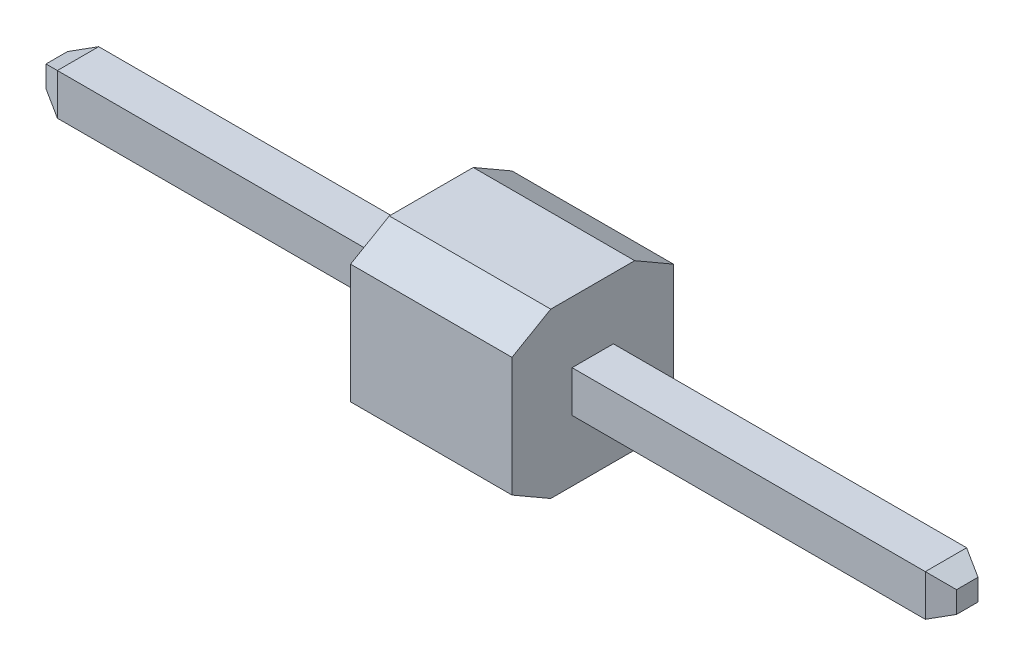
ISO-10303-21;
HEADER;
FILE_DESCRIPTION(('STEP AP214'),'2;1');
FILE_NAME('part.step','',(''),(''),'','','');
FILE_SCHEMA(('AUTOMOTIVE_DESIGN { 1 0 10303 214 1 1 1 1 }'));
ENDSEC;
DATA;
#1=APPLICATION_CONTEXT('core data for automotive mechanical design processes');
#2=APPLICATION_PROTOCOL_DEFINITION('international standard','automotive_design',2000,#1);
#3=PRODUCT_CONTEXT('',#1,'mechanical');
#4=PRODUCT('Part','Part','',(#3));
#5=PRODUCT_RELATED_PRODUCT_CATEGORY('part','',(#4));
#6=PRODUCT_DEFINITION_FORMATION('','',#4);
#7=PRODUCT_DEFINITION_CONTEXT('part definition',#1,'design');
#8=PRODUCT_DEFINITION('design','',#6,#7);
#9=PRODUCT_DEFINITION_SHAPE('','',#8);
#10=(LENGTH_UNIT() NAMED_UNIT(*) SI_UNIT(.MILLI.,.METRE.));
#11=(NAMED_UNIT(*) PLANE_ANGLE_UNIT() SI_UNIT($,.RADIAN.));
#12=(NAMED_UNIT(*) SI_UNIT($,.STERADIAN.) SOLID_ANGLE_UNIT());
#13=UNCERTAINTY_MEASURE_WITH_UNIT(LENGTH_MEASURE(1.E-05),#10,'distance_accuracy_value','');
#14=(GEOMETRIC_REPRESENTATION_CONTEXT(3) GLOBAL_UNCERTAINTY_ASSIGNED_CONTEXT((#13)) GLOBAL_UNIT_ASSIGNED_CONTEXT((#10,
#11,#12)) REPRESENTATION_CONTEXT('',''));
#15=CARTESIAN_POINT('',(0.,0.,0.));
#16=DIRECTION('',(0.,0.,1.));
#17=DIRECTION('',(1.,0.,0.));
#18=AXIS2_PLACEMENT_3D('',#15,#16,#17);
#19=CARTESIAN_POINT('',(5.42107505657293,-2.85712826291391,0.629998634255617));
#20=DIRECTION('',(1.,4.37113882867379E-08,-4.37113882867379E-08));
#21=DIRECTION('',(-4.37113882867379E-08,1.,0.));
#22=AXIS2_PLACEMENT_3D('',#19,#20,#21);
#23=PLANE('',#22);
#24=DIRECTION('',(1.59994777304463E-08,0.500000000000193,0.866025403784327));
#25=VECTOR('',#24,1.);
#26=CARTESIAN_POINT('',(5.42107493358702,-1.61353842442391,-0.940001365744382));
#27=LINE('',#26,#25);
#28=CARTESIAN_POINT('',(5.42107493358702,-1.61353842442391,-0.940001365744382));
#29=VERTEX_POINT('',#28);
#30=CARTESIAN_POINT('',(5.42107494467178,-1.26712826291391,-0.340001365744383));
#31=VERTEX_POINT('',#30);
#32=EDGE_CURVE('E11',#29,#31,#27,.T.);
#33=ORIENTED_EDGE('',*,*,#32,.T.);
#34=DIRECTION('',(4.37113886966664E-08,0.,0.999999999999999));
#35=VECTOR('',#34,1.);
#36=CARTESIAN_POINT('',(5.42107494467178,-1.26712826291391,-0.340001365744383));
#37=LINE('',#36,#35);
#38=CARTESIAN_POINT('',(5.42107500149658,-1.26712826291391,0.959998634255618));
#39=VERTEX_POINT('',#38);
#40=EDGE_CURVE('E304',#31,#39,#37,.T.);
#41=ORIENTED_EDGE('',*,*,#40,.T.);
#42=DIRECTION('',(5.97108668825761E-08,-0.500000000000188,0.866025403784328));
#43=VECTOR('',#42,1.);
#44=CARTESIAN_POINT('',(5.42107500149658,-1.26712826291391,0.959998634255618));
#45=LINE('',#44,#43);
#46=CARTESIAN_POINT('',(5.42107504286549,-1.61353842442391,1.55999863425562));
#47=VERTEX_POINT('',#46);
#48=EDGE_CURVE('E296',#39,#47,#45,.T.);
#49=ORIENTED_EDGE('',*,*,#48,.T.);
#50=DIRECTION('',(4.37113884815545E-08,-0.999999999999999,0.));
#51=VECTOR('',#50,1.);
#52=CARTESIAN_POINT('',(5.42107504286549,-1.61353842442391,1.55999863425562));
#53=LINE('',#52,#51);
#54=CARTESIAN_POINT('',(5.42107512360828,-3.46071810139391,1.55999863425562));
#55=VERTEX_POINT('',#54);
#56=EDGE_CURVE('E281',#47,#55,#53,.T.);
#57=ORIENTED_EDGE('',*,*,#56,.T.);
#58=DIRECTION('',(1.5999479012306E-08,0.500000000000193,0.866025403784327));
#59=VECTOR('',#58,1.);
#60=CARTESIAN_POINT('',(5.42107511252351,-3.80712826291391,0.959998634255618));
#61=LINE('',#60,#59);
#62=CARTESIAN_POINT('',(5.42107511252351,-3.80712826291391,0.959998634255618));
#63=VERTEX_POINT('',#62);
#64=EDGE_CURVE('E265',#63,#55,#61,.T.);
#65=ORIENTED_EDGE('',*,*,#64,.F.);
#66=DIRECTION('',(4.37113886966664E-08,0.,0.999999999999999));
#67=VECTOR('',#66,1.);
#68=CARTESIAN_POINT('',(5.42107505569871,-3.80712826291392,-0.340001365744383));
#69=LINE('',#68,#67);
#70=CARTESIAN_POINT('',(5.42107505569871,-3.80712826291392,-0.340001365744383));
#71=VERTEX_POINT('',#70);
#72=EDGE_CURVE('E248',#71,#63,#69,.T.);
#73=ORIENTED_EDGE('',*,*,#72,.F.);
#74=DIRECTION('',(5.97108656001698E-08,-0.50000000000019,0.866025403784327));
#75=VECTOR('',#74,1.);
#76=CARTESIAN_POINT('',(5.4210750143298,-3.46071810139392,-0.940001365744382));
#77=LINE('',#76,#75);
#78=CARTESIAN_POINT('',(5.4210750143298,-3.46071810139392,-0.940001365744382));
#79=VERTEX_POINT('',#78);
#80=EDGE_CURVE('E242',#79,#71,#77,.T.);
#81=ORIENTED_EDGE('',*,*,#80,.F.);
#82=DIRECTION('',(4.37113884815545E-08,-0.999999999999999,0.));
#83=VECTOR('',#82,1.);
#84=CARTESIAN_POINT('',(5.42107493358702,-1.61353842442391,-0.940001365744382));
#85=LINE('',#84,#83);
#86=EDGE_CURVE('E236',#29,#79,#85,.T.);
#87=ORIENTED_EDGE('',*,*,#86,.F.);
#88=EDGE_LOOP('',(#33,#41,#49,#57,#65,#73,#81,#87));
#89=FACE_BOUND('',#88,.T.);
#90=DIRECTION('',(-4.37113886753159E-08,0.,-0.999999999999999));
#91=VECTOR('',#90,1.);
#92=CARTESIAN_POINT('',(5.42107502859765,-2.21712826291391,0.629998634255617));
#93=LINE('',#92,#91);
#94=CARTESIAN_POINT('',(5.42107502859765,-2.21712826291391,0.629998634255617));
#95=VERTEX_POINT('',#94);
#96=CARTESIAN_POINT('',(5.42107500062236,-2.21712826291391,-0.0100013657443826));
#97=VERTEX_POINT('',#96);
#98=EDGE_CURVE('E302',#95,#97,#93,.T.);
#99=ORIENTED_EDGE('',*,*,#98,.T.);
#100=DIRECTION('',(-4.3711388675316E-08,0.999999999999999,0.));
#101=VECTOR('',#100,1.);
#102=CARTESIAN_POINT('',(5.42107502859765,-2.85712826291391,-0.0100013657443826));
#103=LINE('',#102,#101);
#104=CARTESIAN_POINT('',(5.42107502859765,-2.85712826291391,-0.0100013657443826));
#105=VERTEX_POINT('',#104);
#106=EDGE_CURVE('E293',#105,#97,#103,.T.);
#107=ORIENTED_EDGE('',*,*,#106,.F.);
#108=DIRECTION('',(-4.37113886753159E-08,0.,-0.999999999999999));
#109=VECTOR('',#108,1.);
#110=CARTESIAN_POINT('',(5.42107505657293,-2.85712826291391,0.629998634255617));
#111=LINE('',#110,#109);
#112=CARTESIAN_POINT('',(5.42107505657293,-2.85712826291391,0.629998634255617));
#113=VERTEX_POINT('',#112);
#114=EDGE_CURVE('E278',#113,#105,#111,.T.);
#115=ORIENTED_EDGE('',*,*,#114,.F.);
#116=DIRECTION('',(-4.3711388675316E-08,0.999999999999999,0.));
#117=VECTOR('',#116,1.);
#118=CARTESIAN_POINT('',(5.42107505657293,-2.85712826291391,0.629998634255617));
#119=LINE('',#118,#117);
#120=EDGE_CURVE('E263',#113,#95,#119,.T.);
#121=ORIENTED_EDGE('',*,*,#120,.T.);
#122=EDGE_LOOP('',(#99,#107,#115,#121));
#123=FACE_BOUND('',#122,.T.);
#124=ADVANCED_FACE('F17',(#89,#123),#23,.T.);
#125=CARTESIAN_POINT('',(2.92107505657293,-2.85712837219238,0.629998743534088));
#126=DIRECTION('',(1.,4.37113882867379E-08,-4.37113882867379E-08));
#127=DIRECTION('',(-4.37113882867379E-08,1.,0.));
#128=AXIS2_PLACEMENT_3D('',#125,#126,#127);
#129=PLANE('',#128);
#130=DIRECTION('',(1.59994783714339E-08,0.500000000000193,0.866025403784327));
#131=VECTOR('',#130,1.);
#132=CARTESIAN_POINT('',(2.92107493358702,-1.61353853370239,-0.940001256465912));
#133=LINE('',#132,#131);
#134=CARTESIAN_POINT('',(2.92107493358702,-1.61353853370239,-0.940001256465912));
#135=VERTEX_POINT('',#134);
#136=CARTESIAN_POINT('',(2.92107494467178,-1.26712837219238,-0.340001256465912));
#137=VERTEX_POINT('',#136);
#138=EDGE_CURVE('E24',#135,#137,#133,.T.);
#139=ORIENTED_EDGE('',*,*,#138,.F.);
#140=DIRECTION('',(4.37113882411397E-08,-0.999999999999999,0.));
#141=VECTOR('',#140,1.);
#142=CARTESIAN_POINT('',(2.92107493358702,-1.61353853370239,-0.940001256465912));
#143=LINE('',#142,#141);
#144=CARTESIAN_POINT('',(2.9210750143298,-3.46071821067239,-0.940001256465912));
#145=VERTEX_POINT('',#144);
#146=EDGE_CURVE('E300',#135,#145,#143,.T.);
#147=ORIENTED_EDGE('',*,*,#146,.T.);
#148=DIRECTION('',(5.97108668821449E-08,-0.50000000000019,0.866025403784327));
#149=VECTOR('',#148,1.);
#150=CARTESIAN_POINT('',(2.9210750143298,-3.46071821067239,-0.940001256465912));
#151=LINE('',#150,#149);
#152=CARTESIAN_POINT('',(2.92107505569871,-3.80712837219239,-0.340001256465912));
#153=VERTEX_POINT('',#152);
#154=EDGE_CURVE('E286',#145,#153,#151,.T.);
#155=ORIENTED_EDGE('',*,*,#154,.T.);
#156=DIRECTION('',(4.37113883550593E-08,0.,0.999999999999999));
#157=VECTOR('',#156,1.);
#158=CARTESIAN_POINT('',(2.92107505569871,-3.80712837219239,-0.340001256465912));
#159=LINE('',#158,#157);
#160=CARTESIAN_POINT('',(2.92107511252351,-3.80712837219238,0.959998743534088));
#161=VERTEX_POINT('',#160);
#162=EDGE_CURVE('E271',#153,#161,#159,.T.);
#163=ORIENTED_EDGE('',*,*,#162,.T.);
#164=DIRECTION('',(1.59994783713184E-08,0.500000000000193,0.866025403784327));
#165=VECTOR('',#164,1.);
#166=CARTESIAN_POINT('',(2.92107511252351,-3.80712837219238,0.959998743534088));
#167=LINE('',#166,#165);
#168=CARTESIAN_POINT('',(2.92107512360828,-3.46071821067238,1.55999874353409));
#169=VERTEX_POINT('',#168);
#170=EDGE_CURVE('E253',#161,#169,#167,.T.);
#171=ORIENTED_EDGE('',*,*,#170,.T.);
#172=DIRECTION('',(4.37113882411397E-08,-0.999999999999999,0.));
#173=VECTOR('',#172,1.);
#174=CARTESIAN_POINT('',(2.92107504286549,-1.61353853370238,1.55999874353409));
#175=LINE('',#174,#173);
#176=CARTESIAN_POINT('',(2.92107504286549,-1.61353853370238,1.55999874353409));
#177=VERTEX_POINT('',#176);
#178=EDGE_CURVE('E261',#177,#169,#175,.T.);
#179=ORIENTED_EDGE('',*,*,#178,.F.);
#180=DIRECTION('',(5.97108668825761E-08,-0.500000000000188,0.866025403784328));
#181=VECTOR('',#180,1.);
#182=CARTESIAN_POINT('',(2.92107500149659,-1.26712837219238,0.959998743534088));
#183=LINE('',#182,#181);
#184=CARTESIAN_POINT('',(2.92107500149659,-1.26712837219238,0.959998743534088));
#185=VERTEX_POINT('',#184);
#186=EDGE_CURVE('E276',#185,#177,#183,.T.);
#187=ORIENTED_EDGE('',*,*,#186,.F.);
#188=DIRECTION('',(4.37113883550593E-08,0.,0.999999999999999));
#189=VECTOR('',#188,1.);
#190=CARTESIAN_POINT('',(2.92107494467178,-1.26712837219238,-0.340001256465912));
#191=LINE('',#190,#189);
#192=EDGE_CURVE('E291',#137,#185,#191,.T.);
#193=ORIENTED_EDGE('',*,*,#192,.F.);
#194=EDGE_LOOP('',(#139,#147,#155,#163,#171,#179,#187,#193));
#195=FACE_BOUND('',#194,.T.);
#196=DIRECTION('',(-4.3711388675316E-08,0.999999999999999,0.));
#197=VECTOR('',#196,1.);
#198=CARTESIAN_POINT('',(2.92107502859765,-2.85712837219238,-0.0100012564659119));
#199=LINE('',#198,#197);
#200=CARTESIAN_POINT('',(2.92107502859765,-2.85712837219238,-0.0100012564659119));
#201=VERTEX_POINT('',#200);
#202=CARTESIAN_POINT('',(2.92107500062236,-2.21712837219238,-0.0100012564659119));
#203=VERTEX_POINT('',#202);
#204=EDGE_CURVE('E298',#201,#203,#199,.T.);
#205=ORIENTED_EDGE('',*,*,#204,.T.);
#206=DIRECTION('',(-4.37113886753159E-08,0.,-0.999999999999999));
#207=VECTOR('',#206,1.);
#208=CARTESIAN_POINT('',(2.92107502859765,-2.21712837219238,0.629998743534088));
#209=LINE('',#208,#207);
#210=CARTESIAN_POINT('',(2.92107502859765,-2.21712837219238,0.629998743534088));
#211=VERTEX_POINT('',#210);
#212=EDGE_CURVE('E283',#211,#203,#209,.T.);
#213=ORIENTED_EDGE('',*,*,#212,.F.);
#214=DIRECTION('',(-4.37113879814266E-08,0.999999999999999,0.));
#215=VECTOR('',#214,1.);
#216=CARTESIAN_POINT('',(2.92107505657293,-2.85712837219238,0.629998743534088));
#217=LINE('',#216,#215);
#218=CARTESIAN_POINT('',(2.92107505657293,-2.85712837219238,0.629998743534088));
#219=VERTEX_POINT('',#218);
#220=EDGE_CURVE('E268',#219,#211,#217,.T.);
#221=ORIENTED_EDGE('',*,*,#220,.F.);
#222=DIRECTION('',(-4.37113879814266E-08,0.,-0.999999999999999));
#223=VECTOR('',#222,1.);
#224=CARTESIAN_POINT('',(2.92107505657293,-2.85712837219238,0.629998743534088));
#225=LINE('',#224,#223);
#226=EDGE_CURVE('E251',#219,#201,#225,.T.);
#227=ORIENTED_EDGE('',*,*,#226,.T.);
#228=EDGE_LOOP('',(#205,#213,#221,#227));
#229=FACE_BOUND('',#228,.T.);
#230=ADVANCED_FACE('F314',(#195,#229),#129,.F.);
#231=CARTESIAN_POINT('',(5.42107493358702,-1.61353842442391,-0.940001365744382));
#232=DIRECTION('',(5.97108668343731E-08,-0.866025403784328,0.50000000000019));
#233=DIRECTION('',(-1.59994785476185E-08,-0.500000000000192,-0.866025403784329));
#234=AXIS2_PLACEMENT_3D('',#231,#232,#233);
#235=PLANE('',#234);
#236=ORIENTED_EDGE('',*,*,#138,.T.);
#237=DIRECTION('',(-0.999999999999998,-4.37113875761951E-08,4.37113883755557E-08));
#238=VECTOR('',#237,1.);
#239=CARTESIAN_POINT('',(5.42107494467178,-1.26712826291391,-0.340001365744383));
#240=LINE('',#239,#238);
#241=EDGE_CURVE('E288',#31,#137,#240,.T.);
#242=ORIENTED_EDGE('',*,*,#241,.F.);
#243=ORIENTED_EDGE('',*,*,#32,.F.);
#244=DIRECTION('',(-0.999999999999998,-4.37113882867378E-08,4.37113881091022E-08));
#245=VECTOR('',#244,1.);
#246=CARTESIAN_POINT('',(5.42107493358702,-1.61353842442391,-0.940001365744382));
#247=LINE('',#246,#245);
#248=EDGE_CURVE('E256',#29,#135,#247,.T.);
#249=ORIENTED_EDGE('',*,*,#248,.T.);
#250=EDGE_LOOP('',(#236,#242,#243,#249));
#251=FACE_BOUND('',#250,.T.);
#252=ADVANCED_FACE('F306',(#251),#235,.F.);
#253=CARTESIAN_POINT('',(5.42107494467178,-1.26712826291391,-0.340001365744383));
#254=DIRECTION('',(4.37113882867379E-08,-1.,0.));
#255=DIRECTION('',(1.,4.37113882867379E-08,-4.37113882867379E-08));
#256=AXIS2_PLACEMENT_3D('',#253,#254,#255);
#257=PLANE('',#256);
#258=ORIENTED_EDGE('',*,*,#192,.T.);
#259=DIRECTION('',(-0.999999999999998,-4.37113875761951E-08,4.37113882867378E-08));
#260=VECTOR('',#259,1.);
#261=CARTESIAN_POINT('',(5.42107500149658,-1.26712826291391,0.959998634255618));
#262=LINE('',#261,#260);
#263=EDGE_CURVE('E273',#39,#185,#262,.T.);
#264=ORIENTED_EDGE('',*,*,#263,.F.);
#265=ORIENTED_EDGE('',*,*,#40,.F.);
#266=ORIENTED_EDGE('',*,*,#241,.T.);
#267=EDGE_LOOP('',(#258,#264,#265,#266));
#268=FACE_BOUND('',#267,.T.);
#269=ADVANCED_FACE('F311',(#268),#257,.F.);
#270=CARTESIAN_POINT('',(5.42107500149658,-1.26712826291391,0.959998634255618));
#271=DIRECTION('',(1.59994785476185E-08,-0.86602540378433,-0.50000000000019));
#272=DIRECTION('',(-5.97108668343731E-08,0.500000000000188,-0.866025403784329));
#273=AXIS2_PLACEMENT_3D('',#270,#271,#272);
#274=PLANE('',#273);
#275=ORIENTED_EDGE('',*,*,#186,.T.);
#276=DIRECTION('',(-0.999999999999998,-4.37113882867378E-08,4.37113882867378E-08));
#277=VECTOR('',#276,1.);
#278=CARTESIAN_POINT('',(5.42107504286549,-1.61353842442391,1.55999863425562));
#279=LINE('',#278,#277);
#280=EDGE_CURVE('E258',#47,#177,#279,.T.);
#281=ORIENTED_EDGE('',*,*,#280,.F.);
#282=ORIENTED_EDGE('',*,*,#48,.F.);
#283=ORIENTED_EDGE('',*,*,#263,.T.);
#284=EDGE_LOOP('',(#275,#281,#282,#283));
#285=FACE_BOUND('',#284,.T.);
#286=ADVANCED_FACE('F319',(#285),#274,.F.);
#287=CARTESIAN_POINT('',(5.42107504286549,-1.61353842442391,1.55999863425562));
#288=DIRECTION('',(-4.37113882867379E-08,0.,-1.));
#289=DIRECTION('',(-1.,-4.37113882867379E-08,4.37113882867379E-08));
#290=AXIS2_PLACEMENT_3D('',#287,#288,#289);
#291=PLANE('',#290);
#292=ORIENTED_EDGE('',*,*,#178,.T.);
#293=DIRECTION('',(-0.999999999999998,-4.37113882867378E-08,4.37113882867378E-08));
#294=VECTOR('',#293,1.);
#295=CARTESIAN_POINT('',(5.42107512360828,-3.46071810139391,1.55999863425562));
#296=LINE('',#295,#294);
#297=EDGE_CURVE('E245',#55,#169,#296,.T.);
#298=ORIENTED_EDGE('',*,*,#297,.F.);
#299=ORIENTED_EDGE('',*,*,#56,.F.);
#300=ORIENTED_EDGE('',*,*,#280,.T.);
#301=EDGE_LOOP('',(#292,#298,#299,#300));
#302=FACE_BOUND('',#301,.T.);
#303=ADVANCED_FACE('F326',(#302),#291,.F.);
#304=CARTESIAN_POINT('',(5.42107511252351,-3.80712826291391,0.959998634255618));
#305=DIRECTION('',(5.97108668343731E-08,-0.866025403784328,0.50000000000019));
#306=DIRECTION('',(-1.59994785476185E-08,-0.500000000000192,-0.866025403784329));
#307=AXIS2_PLACEMENT_3D('',#304,#305,#306);
#308=PLANE('',#307);
#309=ORIENTED_EDGE('',*,*,#170,.F.);
#310=DIRECTION('',(-0.999999999999998,-4.37113868656524E-08,4.37113882867378E-08));
#311=VECTOR('',#310,1.);
#312=CARTESIAN_POINT('',(5.42107511252351,-3.80712826291391,0.959998634255618));
#313=LINE('',#312,#311);
#314=EDGE_CURVE('E239',#63,#161,#313,.T.);
#315=ORIENTED_EDGE('',*,*,#314,.F.);
#316=ORIENTED_EDGE('',*,*,#64,.T.);
#317=ORIENTED_EDGE('',*,*,#297,.T.);
#318=EDGE_LOOP('',(#309,#315,#316,#317));
#319=FACE_BOUND('',#318,.T.);
#320=ADVANCED_FACE('F329',(#319),#308,.T.);
#321=CARTESIAN_POINT('',(5.42107505569871,-3.80712826291392,-0.340001365744383));
#322=DIRECTION('',(4.37113882867379E-08,-1.,0.));
#323=DIRECTION('',(1.,4.37113882867379E-08,-4.37113882867379E-08));
#324=AXIS2_PLACEMENT_3D('',#321,#322,#323);
#325=PLANE('',#324);
#326=ORIENTED_EDGE('',*,*,#162,.F.);
#327=DIRECTION('',(-0.999999999999998,-4.37113868656524E-08,4.37113883755557E-08));
#328=VECTOR('',#327,1.);
#329=CARTESIAN_POINT('',(5.42107505569871,-3.80712826291392,-0.340001365744383));
#330=LINE('',#329,#328);
#331=EDGE_CURVE('E233',#71,#153,#330,.T.);
#332=ORIENTED_EDGE('',*,*,#331,.F.);
#333=ORIENTED_EDGE('',*,*,#72,.T.);
#334=ORIENTED_EDGE('',*,*,#314,.T.);
#335=EDGE_LOOP('',(#326,#332,#333,#334));
#336=FACE_BOUND('',#335,.T.);
#337=ADVANCED_FACE('F333',(#336),#325,.T.);
#338=CARTESIAN_POINT('',(5.4210750143298,-3.46071810139392,-0.940001365744382));
#339=DIRECTION('',(1.59994785476185E-08,-0.86602540378433,-0.50000000000019));
#340=DIRECTION('',(-5.97108668343731E-08,0.500000000000188,-0.866025403784329));
#341=AXIS2_PLACEMENT_3D('',#338,#339,#340);
#342=PLANE('',#341);
#343=ORIENTED_EDGE('',*,*,#154,.F.);
#344=DIRECTION('',(-0.999999999999998,-4.37113882867378E-08,4.37113881091021E-08));
#345=VECTOR('',#344,1.);
#346=CARTESIAN_POINT('',(5.4210750143298,-3.46071810139392,-0.940001365744382));
#347=LINE('',#346,#345);
#348=EDGE_CURVE('E230',#79,#145,#347,.T.);
#349=ORIENTED_EDGE('',*,*,#348,.F.);
#350=ORIENTED_EDGE('',*,*,#80,.T.);
#351=ORIENTED_EDGE('',*,*,#331,.T.);
#352=EDGE_LOOP('',(#343,#349,#350,#351));
#353=FACE_BOUND('',#352,.T.);
#354=ADVANCED_FACE('F337',(#353),#342,.T.);
#355=CARTESIAN_POINT('',(5.42107493358702,-1.61353842442391,-0.940001365744382));
#356=DIRECTION('',(-4.37113882867379E-08,0.,-1.));
#357=DIRECTION('',(-4.37113882867379E-08,1.,0.));
#358=AXIS2_PLACEMENT_3D('',#355,#356,#357);
#359=PLANE('',#358);
#360=ORIENTED_EDGE('',*,*,#146,.F.);
#361=ORIENTED_EDGE('',*,*,#248,.F.);
#362=ORIENTED_EDGE('',*,*,#86,.T.);
#363=ORIENTED_EDGE('',*,*,#348,.T.);
#364=EDGE_LOOP('',(#360,#361,#362,#363));
#365=FACE_BOUND('',#364,.T.);
#366=ADVANCED_FACE('F339',(#365),#359,.T.);
#367=CARTESIAN_POINT('',(-2.87892494342706,-2.85712862571843,0.62999899706014));
#368=DIRECTION('',(-1.,-4.37113882867379E-08,4.37113882867379E-08));
#369=DIRECTION('',(4.37113882867379E-08,-1.,0.));
#370=AXIS2_PLACEMENT_3D('',#367,#368,#369);
#371=PLANE('',#370);
#372=DIRECTION('',(4.3711387402424E-08,-0.999999999999999,0.));
#373=VECTOR('',#372,1.);
#374=CARTESIAN_POINT('',(-2.87892498592489,-2.37101015290844,0.14388052425114));
#375=LINE('',#374,#373);
#376=CARTESIAN_POINT('',(-2.87892498592489,-2.37101015290844,0.14388052425114));
#377=VERTEX_POINT('',#376);
#378=CARTESIAN_POINT('',(-2.87892497140235,-2.70324709851844,0.14388052425114));
#379=VERTEX_POINT('',#378);
#380=EDGE_CURVE('E228',#377,#379,#375,.T.);
#381=ORIENTED_EDGE('',*,*,#380,.T.);
#382=DIRECTION('',(4.37113874013716E-08,0.,0.999999999999999));
#383=VECTOR('',#382,1.);
#384=CARTESIAN_POINT('',(-2.87892497140235,-2.70324709851844,0.14388052425114));
#385=LINE('',#384,#383);
#386=CARTESIAN_POINT('',(-2.87892495687982,-2.70324709851844,0.47611746986914));
#387=VERTEX_POINT('',#386);
#388=EDGE_CURVE('E223',#379,#387,#385,.T.);
#389=ORIENTED_EDGE('',*,*,#388,.T.);
#390=DIRECTION('',(-4.37113900757526E-08,0.999999999999999,0.));
#391=VECTOR('',#390,1.);
#392=CARTESIAN_POINT('',(-2.87892495687982,-2.70324709851843,0.47611746986914));
#393=LINE('',#392,#391);
#394=CARTESIAN_POINT('',(-2.87892497140235,-2.37101015290843,0.47611746986914));
#395=VERTEX_POINT('',#394);
#396=EDGE_CURVE('E215',#387,#395,#393,.T.);
#397=ORIENTED_EDGE('',*,*,#396,.T.);
#398=DIRECTION('',(-4.37113847280434E-08,0.,-0.999999999999999));
#399=VECTOR('',#398,1.);
#400=CARTESIAN_POINT('',(-2.87892497140235,-2.37101015290843,0.47611746986914));
#401=LINE('',#400,#399);
#402=EDGE_CURVE('E207',#395,#377,#401,.T.);
#403=ORIENTED_EDGE('',*,*,#402,.T.);
#404=EDGE_LOOP('',(#381,#389,#397,#403));
#405=FACE_BOUND('',#404,.T.);
#406=ADVANCED_FACE('F341',(#405),#371,.T.);
#407=CARTESIAN_POINT('',(-2.87892494342706,-2.85712862571843,0.62999899706014));
#408=DIRECTION('',(4.37113882867379E-08,-1.,0.));
#409=DIRECTION('',(-4.37113882867379E-08,0.,-1.));
#410=AXIS2_PLACEMENT_3D('',#407,#408,#409);
#411=PLANE('',#410);
#412=DIRECTION('',(0.999999999999998,4.37113891700451E-08,-4.37113882769955E-08));
#413=VECTOR('',#412,1.);
#414=CARTESIAN_POINT('',(-2.54892494342706,-2.85712861129368,0.629998982635382));
#415=LINE('',#414,#413);
#416=CARTESIAN_POINT('',(-2.54892494342706,-2.85712861129368,0.629998982635382));
#417=VERTEX_POINT('',#416);
#418=EDGE_CURVE('E225',#417,#219,#415,.T.);
#419=ORIENTED_EDGE('',*,*,#418,.F.);
#420=DIRECTION('',(-4.37113886753159E-08,0.,-0.999999999999999));
#421=VECTOR('',#420,1.);
#422=CARTESIAN_POINT('',(-2.54892494342706,-2.85712861129368,0.629998982635382));
#423=LINE('',#422,#421);
#424=CARTESIAN_POINT('',(-2.54892497140235,-2.85712861129368,-0.010001017364618));
#425=VERTEX_POINT('',#424);
#426=EDGE_CURVE('E217',#417,#425,#423,.T.);
#427=ORIENTED_EDGE('',*,*,#426,.T.);
#428=DIRECTION('',(0.999999999999998,4.37113891700451E-08,-4.37113882161057E-08));
#429=VECTOR('',#428,1.);
#430=CARTESIAN_POINT('',(-2.54892497140235,-2.85712861129368,-0.010001017364618));
#431=LINE('',#430,#429);
#432=EDGE_CURVE('E220',#425,#201,#431,.T.);
#433=ORIENTED_EDGE('',*,*,#432,.T.);
#434=ORIENTED_EDGE('',*,*,#226,.F.);
#435=EDGE_LOOP('',(#419,#427,#433,#434));
#436=FACE_BOUND('',#435,.T.);
#437=ADVANCED_FACE('F348',(#436),#411,.T.);
#438=CARTESIAN_POINT('',(-2.87892497140235,-2.85712862571844,-0.0100010029398598));
#439=DIRECTION('',(-4.37113882867379E-08,0.,-1.));
#440=DIRECTION('',(-1.,-4.37113882867379E-08,4.37113882867379E-08));
#441=AXIS2_PLACEMENT_3D('',#438,#439,#440);
#442=PLANE('',#441);
#443=ORIENTED_EDGE('',*,*,#432,.F.);
#444=DIRECTION('',(-4.3711388675316E-08,0.999999999999999,0.));
#445=VECTOR('',#444,1.);
#446=CARTESIAN_POINT('',(-2.54892497140235,-2.85712861129368,-0.010001017364618));
#447=LINE('',#446,#445);
#448=CARTESIAN_POINT('',(-2.54892499937764,-2.21712861129368,-0.010001017364618));
#449=VERTEX_POINT('',#448);
#450=EDGE_CURVE('E209',#425,#449,#447,.T.);
#451=ORIENTED_EDGE('',*,*,#450,.T.);
#452=DIRECTION('',(0.999999999999998,4.37113888452998E-08,-4.37113882161057E-08));
#453=VECTOR('',#452,1.);
#454=CARTESIAN_POINT('',(-2.54892499937764,-2.21712861129368,-0.010001017364618));
#455=LINE('',#454,#453);
#456=EDGE_CURVE('E212',#449,#203,#455,.T.);
#457=ORIENTED_EDGE('',*,*,#456,.T.);
#458=ORIENTED_EDGE('',*,*,#204,.F.);
#459=EDGE_LOOP('',(#443,#451,#457,#458));
#460=FACE_BOUND('',#459,.T.);
#461=ADVANCED_FACE('F424',(#460),#442,.T.);
#462=CARTESIAN_POINT('',(-2.87892497140235,-2.21712862571843,0.62999899706014));
#463=DIRECTION('',(4.37113882867379E-08,-1.,0.));
#464=DIRECTION('',(-4.37113882867379E-08,0.,-1.));
#465=AXIS2_PLACEMENT_3D('',#462,#463,#464);
#466=PLANE('',#465);
#467=ORIENTED_EDGE('',*,*,#456,.F.);
#468=DIRECTION('',(4.37113900630947E-08,0.,0.999999999999999));
#469=VECTOR('',#468,1.);
#470=CARTESIAN_POINT('',(-2.54892499937764,-2.21712861129368,-0.010001017364618));
#471=LINE('',#470,#469);
#472=CARTESIAN_POINT('',(-2.54892497140235,-2.21712861129368,0.629998982635382));
#473=VERTEX_POINT('',#472);
#474=EDGE_CURVE('E201',#449,#473,#471,.T.);
#475=ORIENTED_EDGE('',*,*,#474,.T.);
#476=DIRECTION('',(0.999999999999998,4.37113888452998E-08,-4.37113882769955E-08));
#477=VECTOR('',#476,1.);
#478=CARTESIAN_POINT('',(-2.54892497140235,-2.21712861129367,0.629998982635382));
#479=LINE('',#478,#477);
#480=EDGE_CURVE('E204',#473,#211,#479,.T.);
#481=ORIENTED_EDGE('',*,*,#480,.T.);
#482=ORIENTED_EDGE('',*,*,#212,.T.);
#483=EDGE_LOOP('',(#467,#475,#481,#482));
#484=FACE_BOUND('',#483,.T.);
#485=ADVANCED_FACE('F421',(#484),#466,.F.);
#486=CARTESIAN_POINT('',(-2.87892494342706,-2.85712862571843,0.62999899706014));
#487=DIRECTION('',(-4.37113882867379E-08,0.,-1.));
#488=DIRECTION('',(-1.,-4.37113882867379E-08,4.37113882867379E-08));
#489=AXIS2_PLACEMENT_3D('',#486,#487,#488);
#490=PLANE('',#489);
#491=ORIENTED_EDGE('',*,*,#480,.F.);
#492=DIRECTION('',(4.37113900630948E-08,-0.999999999999999,0.));
#493=VECTOR('',#492,1.);
#494=CARTESIAN_POINT('',(-2.54892497140235,-2.21712861129368,0.629998982635382));
#495=LINE('',#494,#493);
#496=EDGE_CURVE('E196',#473,#417,#495,.T.);
#497=ORIENTED_EDGE('',*,*,#496,.T.);
#498=ORIENTED_EDGE('',*,*,#418,.T.);
#499=ORIENTED_EDGE('',*,*,#220,.T.);
#500=EDGE_LOOP('',(#491,#497,#498,#499));
#501=FACE_BOUND('',#500,.T.);
#502=ADVANCED_FACE('F376',(#501),#490,.F.);
#503=CARTESIAN_POINT('',(-2.87892494342706,-2.85712862571843,0.62999899706014));
#504=DIRECTION('',(-4.37113882867379E-08,0.,-1.));
#505=DIRECTION('',(-1.,-4.37113882867379E-08,4.37113882867379E-08));
#506=AXIS2_PLACEMENT_3D('',#503,#504,#505);
#507=PLANE('',#506);
#508=DIRECTION('',(0.999999999999998,4.37113933917341E-08,-4.37113882769955E-08));
#509=VECTOR('',#508,1.);
#510=CARTESIAN_POINT('',(5.42107505657293,-2.85712826291392,0.629998634255617));
#511=LINE('',#510,#509);
#512=CARTESIAN_POINT('',(10.8910750565729,-2.85712802381262,0.629998395154324));
#513=VERTEX_POINT('',#512);
#514=EDGE_CURVE('E199',#113,#513,#511,.T.);
#515=ORIENTED_EDGE('',*,*,#514,.T.);
#516=DIRECTION('',(-4.37113900630948E-08,0.999999999999999,0.));
#517=VECTOR('',#516,1.);
#518=CARTESIAN_POINT('',(10.8910750565729,-2.85712802381262,0.629998395154324));
#519=LINE('',#518,#517);
#520=CARTESIAN_POINT('',(10.8910750285976,-2.21712802381262,0.629998395154324));
#521=VERTEX_POINT('',#520);
#522=EDGE_CURVE('E191',#513,#521,#519,.T.);
#523=ORIENTED_EDGE('',*,*,#522,.T.);
#524=DIRECTION('',(0.999999999999998,4.37113829998842E-08,-4.37113882769955E-08));
#525=VECTOR('',#524,1.);
#526=CARTESIAN_POINT('',(5.42107502859765,-2.21712826291391,0.629998634255617));
#527=LINE('',#526,#525);
#528=EDGE_CURVE('E194',#95,#521,#527,.T.);
#529=ORIENTED_EDGE('',*,*,#528,.F.);
#530=ORIENTED_EDGE('',*,*,#120,.F.);
#531=EDGE_LOOP('',(#515,#523,#529,#530));
#532=FACE_BOUND('',#531,.T.);
#533=ADVANCED_FACE('F367',(#532),#507,.F.);
#534=CARTESIAN_POINT('',(-2.87892497140235,-2.21712862571843,0.62999899706014));
#535=DIRECTION('',(4.37113882867379E-08,-1.,0.));
#536=DIRECTION('',(-4.37113882867379E-08,0.,-1.));
#537=AXIS2_PLACEMENT_3D('',#534,#535,#536);
#538=PLANE('',#537);
#539=ORIENTED_EDGE('',*,*,#528,.T.);
#540=DIRECTION('',(-4.37113900630947E-08,0.,-0.999999999999999));
#541=VECTOR('',#540,1.);
#542=CARTESIAN_POINT('',(10.8910750285976,-2.21712802381262,0.629998395154324));
#543=LINE('',#542,#541);
#544=CARTESIAN_POINT('',(10.8910750006224,-2.21712802381262,-0.0100016048456765));
#545=VERTEX_POINT('',#544);
#546=EDGE_CURVE('E186',#521,#545,#543,.T.);
#547=ORIENTED_EDGE('',*,*,#546,.T.);
#548=DIRECTION('',(0.999999999999998,4.37113829998842E-08,-4.37113881146228E-08));
#549=VECTOR('',#548,1.);
#550=CARTESIAN_POINT('',(5.42107500062236,-2.21712826291391,-0.0100013657443823));
#551=LINE('',#550,#549);
#552=EDGE_CURVE('E189',#97,#545,#551,.T.);
#553=ORIENTED_EDGE('',*,*,#552,.F.);
#554=ORIENTED_EDGE('',*,*,#98,.F.);
#555=EDGE_LOOP('',(#539,#547,#553,#554));
#556=FACE_BOUND('',#555,.T.);
#557=ADVANCED_FACE('F364',(#556),#538,.F.);
#558=CARTESIAN_POINT('',(-2.87892497140235,-2.85712862571844,-0.0100010029398598));
#559=DIRECTION('',(-4.37113882867379E-08,0.,-1.));
#560=DIRECTION('',(-1.,-4.37113882867379E-08,4.37113882867379E-08));
#561=AXIS2_PLACEMENT_3D('',#558,#559,#560);
#562=PLANE('',#561);
#563=ORIENTED_EDGE('',*,*,#552,.T.);
#564=DIRECTION('',(4.37113872875372E-08,-0.999999999999999,0.));
#565=VECTOR('',#564,1.);
#566=CARTESIAN_POINT('',(10.8910750006224,-2.21712802381262,-0.0100016048456764));
#567=LINE('',#566,#565);
#568=CARTESIAN_POINT('',(10.8910750285976,-2.85712802381262,-0.0100016048456765));
#569=VERTEX_POINT('',#568);
#570=EDGE_CURVE('E176',#545,#569,#567,.T.);
#571=ORIENTED_EDGE('',*,*,#570,.T.);
#572=DIRECTION('',(0.999999999999998,4.37113933917341E-08,-4.37113881146228E-08));
#573=VECTOR('',#572,1.);
#574=CARTESIAN_POINT('',(5.42107502859765,-2.85712826291392,-0.0100013657443823));
#575=LINE('',#574,#573);
#576=EDGE_CURVE('E179',#105,#569,#575,.T.);
#577=ORIENTED_EDGE('',*,*,#576,.F.);
#578=ORIENTED_EDGE('',*,*,#106,.T.);
#579=EDGE_LOOP('',(#563,#571,#577,#578));
#580=FACE_BOUND('',#579,.T.);
#581=ADVANCED_FACE('F366',(#580),#562,.T.);
#582=CARTESIAN_POINT('',(-2.87892494342706,-2.85712862571843,0.62999899706014));
#583=DIRECTION('',(4.37113882867379E-08,-1.,0.));
#584=DIRECTION('',(-4.37113882867379E-08,0.,-1.));
#585=AXIS2_PLACEMENT_3D('',#582,#583,#584);
#586=PLANE('',#585);
#587=ORIENTED_EDGE('',*,*,#576,.T.);
#588=DIRECTION('',(4.37113845119796E-08,0.,0.999999999999999));
#589=VECTOR('',#588,1.);
#590=CARTESIAN_POINT('',(10.8910750285976,-2.85712802381262,-0.0100016048456765));
#591=LINE('',#590,#589);
#592=EDGE_CURVE('E167',#569,#513,#591,.T.);
#593=ORIENTED_EDGE('',*,*,#592,.T.);
#594=ORIENTED_EDGE('',*,*,#514,.F.);
#595=ORIENTED_EDGE('',*,*,#114,.T.);
#596=EDGE_LOOP('',(#587,#593,#594,#595));
#597=FACE_BOUND('',#596,.T.);
#598=ADVANCED_FACE('F373',(#597),#586,.T.);
#599=CARTESIAN_POINT('',(11.2210750565729,-2.85712800938786,0.629998380729565));
#600=DIRECTION('',(-1.,-4.37113882867379E-08,4.37113882867379E-08));
#601=DIRECTION('',(4.37113882867379E-08,-1.,0.));
#602=AXIS2_PLACEMENT_3D('',#599,#600,#601);
#603=PLANE('',#602);
#604=DIRECTION('',(-4.37113874024243E-08,0.999999999999999,0.));
#605=VECTOR('',#604,1.);
#606=CARTESIAN_POINT('',(11.2210750285976,-2.70324648218786,0.143879907920565));
#607=LINE('',#606,#605);
#608=CARTESIAN_POINT('',(11.2210750285976,-2.70324648218786,0.143879907920565));
#609=VERTEX_POINT('',#608);
#610=CARTESIAN_POINT('',(11.2210750140751,-2.37100953657786,0.143879907920565));
#611=VERTEX_POINT('',#610);
#612=EDGE_CURVE('E153',#609,#611,#607,.T.);
#613=ORIENTED_EDGE('',*,*,#612,.T.);
#614=DIRECTION('',(4.37113874013716E-08,0.,0.999999999999999));
#615=VECTOR('',#614,1.);
#616=CARTESIAN_POINT('',(11.2210750140751,-2.37100953657787,0.143879907920565));
#617=LINE('',#616,#615);
#618=CARTESIAN_POINT('',(11.2210750285976,-2.37100953657786,0.476116853538565));
#619=VERTEX_POINT('',#618);
#620=EDGE_CURVE('E395',#611,#619,#617,.T.);
#621=ORIENTED_EDGE('',*,*,#620,.T.);
#622=DIRECTION('',(4.37113927490806E-08,-0.999999999999999,0.));
#623=VECTOR('',#622,1.);
#624=CARTESIAN_POINT('',(11.2210750285976,-2.37100953657786,0.476116853538565));
#625=LINE('',#624,#623);
#626=CARTESIAN_POINT('',(11.2210750431202,-2.70324648218786,0.476116853538565));
#627=VERTEX_POINT('',#626);
#628=EDGE_CURVE('E156',#619,#627,#625,.T.);
#629=ORIENTED_EDGE('',*,*,#628,.T.);
#630=DIRECTION('',(-4.37113980946847E-08,0.,-0.999999999999999));
#631=VECTOR('',#630,1.);
#632=CARTESIAN_POINT('',(11.2210750431202,-2.70324648218786,0.476116853538565));
#633=LINE('',#632,#631);
#634=EDGE_CURVE('E149',#627,#609,#633,.T.);
#635=ORIENTED_EDGE('',*,*,#634,.T.);
#636=EDGE_LOOP('',(#613,#621,#629,#635));
#637=FACE_BOUND('',#636,.T.);
#638=ADVANCED_FACE('F151',(#637),#603,.F.);
#639=CARTESIAN_POINT('',(-2.87892496467598,-2.37101015290843,0.62999899706014));
#640=DIRECTION('',(-0.422618301356784,0.906307768563367,1.84732310895534E-08));
#641=DIRECTION('',(4.37113882867379E-08,0.,1.));
#642=AXIS2_PLACEMENT_3D('',#639,#640,#641);
#643=PLANE('',#642);
#644=DIRECTION('',(0.834817095446927,0.389281657126017,-0.389281657126018));
#645=VECTOR('',#644,1.);
#646=CARTESIAN_POINT('',(-2.87892498592491,-2.37101015290792,0.143880524251623));
#647=LINE('',#646,#645);
#648=EDGE_CURVE('E181',#377,#449,#647,.T.);
#649=ORIENTED_EDGE('',*,*,#648,.F.);
#650=ORIENTED_EDGE('',*,*,#402,.F.);
#651=DIRECTION('',(-0.834817129479006,-0.389281657126019,-0.389281584143989));
#652=VECTOR('',#651,1.);
#653=CARTESIAN_POINT('',(-2.54892497140279,-2.21712861129221,0.629998982634844));
#654=LINE('',#653,#652);
#655=EDGE_CURVE('E404',#473,#395,#654,.T.);
#656=ORIENTED_EDGE('',*,*,#655,.F.);
#657=ORIENTED_EDGE('',*,*,#474,.F.);
#658=EDGE_LOOP('',(#649,#650,#656,#657));
#659=FACE_BOUND('',#658,.T.);
#660=ADVANCED_FACE('F418',(#659),#643,.T.);
#661=CARTESIAN_POINT('',(-2.87892495015344,-2.85712862571843,0.47611746986914));
#662=DIRECTION('',(-0.422618222124841,-1.84732292043498E-08,0.906307805509828));
#663=DIRECTION('',(4.37113882867379E-08,-1.,0.));
#664=AXIS2_PLACEMENT_3D('',#661,#662,#663);
#665=PLANE('',#664);
#666=ORIENTED_EDGE('',*,*,#655,.T.);
#667=ORIENTED_EDGE('',*,*,#396,.F.);
#668=DIRECTION('',(-0.834817163511088,0.389281584143984,-0.389281584143987));
#669=VECTOR('',#668,1.);
#670=CARTESIAN_POINT('',(-2.54892494342592,-2.85712861129095,0.629998982635654));
#671=LINE('',#670,#669);
#672=EDGE_CURVE('E160',#417,#387,#671,.T.);
#673=ORIENTED_EDGE('',*,*,#672,.F.);
#674=ORIENTED_EDGE('',*,*,#496,.F.);
#675=EDGE_LOOP('',(#666,#667,#673,#674));
#676=FACE_BOUND('',#675,.T.);
#677=ADVANCED_FACE('F434',(#676),#665,.T.);
#678=CARTESIAN_POINT('',(-2.54892497140235,-2.85712861129368,-0.010001017364618));
#679=DIRECTION('',(0.422618301356784,1.8473232667688E-08,0.906307768563367));
#680=DIRECTION('',(-4.37113882867379E-08,1.,0.));
#681=AXIS2_PLACEMENT_3D('',#678,#679,#680);
#682=PLANE('',#681);
#683=ORIENTED_EDGE('',*,*,#648,.T.);
#684=ORIENTED_EDGE('',*,*,#450,.F.);
#685=DIRECTION('',(0.834817129479008,-0.389281584143985,-0.389281657126018));
#686=VECTOR('',#685,1.);
#687=CARTESIAN_POINT('',(-2.87892497140519,-2.70324709852598,0.1438805242526));
#688=LINE('',#687,#686);
#689=EDGE_CURVE('E170',#379,#425,#688,.T.);
#690=ORIENTED_EDGE('',*,*,#689,.F.);
#691=ORIENTED_EDGE('',*,*,#380,.F.);
#692=EDGE_LOOP('',(#683,#684,#690,#691));
#693=FACE_BOUND('',#692,.T.);
#694=ADVANCED_FACE('F413',(#693),#682,.F.);
#695=CARTESIAN_POINT('',(-2.54892494342706,-2.85712861129368,0.629998982635382));
#696=DIRECTION('',(0.422618222124841,0.906307805509828,-1.84732308250282E-08));
#697=DIRECTION('',(-4.37113882867379E-08,0.,-1.));
#698=AXIS2_PLACEMENT_3D('',#695,#696,#697);
#699=PLANE('',#698);
#700=ORIENTED_EDGE('',*,*,#672,.T.);
#701=ORIENTED_EDGE('',*,*,#388,.F.);
#702=ORIENTED_EDGE('',*,*,#689,.T.);
#703=ORIENTED_EDGE('',*,*,#426,.F.);
#704=EDGE_LOOP('',(#700,#701,#702,#703));
#705=FACE_BOUND('',#704,.T.);
#706=ADVANCED_FACE('F429',(#705),#699,.F.);
#707=CARTESIAN_POINT('',(11.2210750498466,-2.70324648218786,0.629998380729565));
#708=DIRECTION('',(0.422618301356784,-0.906307768563367,-1.84732310470096E-08));
#709=DIRECTION('',(4.37113882867379E-08,0.,1.));
#710=AXIS2_PLACEMENT_3D('',#707,#708,#709);
#711=PLANE('',#710);
#712=DIRECTION('',(-0.834817129479007,-0.389281657126017,-0.389281584143988));
#713=VECTOR('',#712,1.);
#714=CARTESIAN_POINT('',(11.2210750285977,-2.70324648218838,0.143879907921048));
#715=LINE('',#714,#713);
#716=EDGE_CURVE('E164',#609,#569,#715,.T.);
#717=ORIENTED_EDGE('',*,*,#716,.F.);
#718=ORIENTED_EDGE('',*,*,#634,.F.);
#719=DIRECTION('',(0.834817095446928,0.389281657126015,-0.389281657126018));
#720=VECTOR('',#719,1.);
#721=CARTESIAN_POINT('',(10.8910750565729,-2.85712802381262,0.629998395154324));
#722=LINE('',#721,#720);
#723=EDGE_CURVE('E392',#513,#627,#722,.T.);
#724=ORIENTED_EDGE('',*,*,#723,.F.);
#725=ORIENTED_EDGE('',*,*,#592,.F.);
#726=EDGE_LOOP('',(#717,#718,#724,#725));
#727=FACE_BOUND('',#726,.T.);
#728=ADVANCED_FACE('F165',(#727),#711,.T.);
#729=CARTESIAN_POINT('',(10.8910750565729,-2.85712802381262,0.629998395154324));
#730=DIRECTION('',(-0.422618301356784,-1.8473232667688E-08,-0.906307768563367));
#731=DIRECTION('',(-4.37113882867379E-08,1.,0.));
#732=AXIS2_PLACEMENT_3D('',#729,#730,#731);
#733=PLANE('',#732);
#734=ORIENTED_EDGE('',*,*,#723,.T.);
#735=ORIENTED_EDGE('',*,*,#628,.F.);
#736=DIRECTION('',(0.834817129479004,-0.389281584143993,-0.389281657126018));
#737=VECTOR('',#736,1.);
#738=CARTESIAN_POINT('',(10.8910750285992,-2.21712802380841,0.629998395153421));
#739=LINE('',#738,#737);
#740=EDGE_CURVE('E389',#521,#619,#739,.T.);
#741=ORIENTED_EDGE('',*,*,#740,.F.);
#742=ORIENTED_EDGE('',*,*,#522,.F.);
#743=EDGE_LOOP('',(#734,#735,#741,#742));
#744=FACE_BOUND('',#743,.T.);
#745=ADVANCED_FACE('F390',(#744),#733,.F.);
#746=CARTESIAN_POINT('',(11.221075035324,-2.85712800938786,0.143879907920565));
#747=DIRECTION('',(0.422618222124841,1.84732292043498E-08,-0.906307805509828));
#748=DIRECTION('',(4.37113882867379E-08,-1.,0.));
#749=AXIS2_PLACEMENT_3D('',#746,#747,#748);
#750=PLANE('',#749);
#751=ORIENTED_EDGE('',*,*,#716,.T.);
#752=ORIENTED_EDGE('',*,*,#570,.F.);
#753=DIRECTION('',(-0.834817163511087,0.389281584143985,-0.389281584143988));
#754=VECTOR('',#753,1.);
#755=CARTESIAN_POINT('',(11.2210750140751,-2.37100953657734,0.143879907921048));
#756=LINE('',#755,#754);
#757=EDGE_CURVE('E175',#611,#545,#756,.T.);
#758=ORIENTED_EDGE('',*,*,#757,.F.);
#759=ORIENTED_EDGE('',*,*,#612,.F.);
#760=EDGE_LOOP('',(#751,#752,#758,#759));
#761=FACE_BOUND('',#760,.T.);
#762=ADVANCED_FACE('F173',(#761),#750,.T.);
#763=CARTESIAN_POINT('',(10.8910750285976,-2.21712802381262,0.629998395154324));
#764=DIRECTION('',(-0.422618222124841,-0.906307805509828,1.84732307824844E-08));
#765=DIRECTION('',(-4.37113882867379E-08,0.,-1.));
#766=AXIS2_PLACEMENT_3D('',#763,#764,#765);
#767=PLANE('',#766);
#768=ORIENTED_EDGE('',*,*,#740,.T.);
#769=ORIENTED_EDGE('',*,*,#620,.F.);
#770=ORIENTED_EDGE('',*,*,#757,.T.);
#771=ORIENTED_EDGE('',*,*,#546,.F.);
#772=EDGE_LOOP('',(#768,#769,#770,#771));
#773=FACE_BOUND('',#772,.T.);
#774=ADVANCED_FACE('F394',(#773),#767,.F.);
#775=CLOSED_SHELL('',(#124,#230,#252,#269,#286,#303,#320,#337,#354,#366,#406,#437,#461,#485,
#502,#533,#557,#581,#598,#638,#660,#677,#694,#706,#728,#745,#762,#774));
#776=MANIFOLD_SOLID_BREP('B1',#775);
#777=ADVANCED_BREP_SHAPE_REPRESENTATION('',(#18,#776),#14);
#778=SHAPE_DEFINITION_REPRESENTATION(#9,#777);
ENDSEC;
END-ISO-10303-21;
